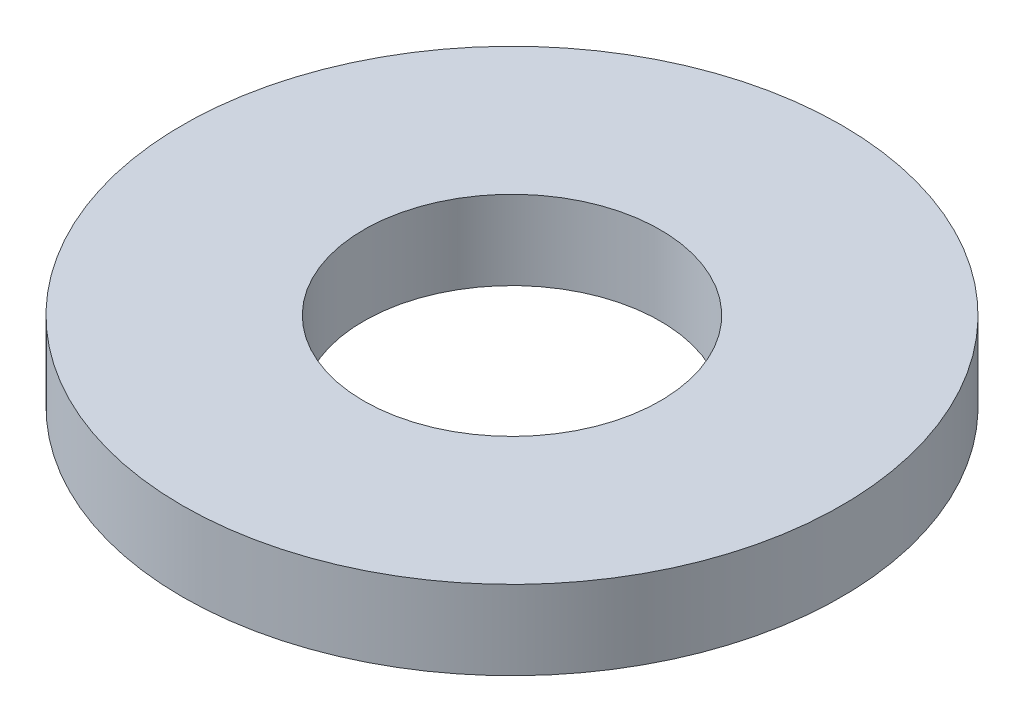
ISO-10303-21;
HEADER;
FILE_DESCRIPTION(('STEP AP214'),'2;1');
FILE_NAME('part.step','',(''),(''),'','','');
FILE_SCHEMA(('AUTOMOTIVE_DESIGN { 1 0 10303 214 1 1 1 1 }'));
ENDSEC;
DATA;
#1=APPLICATION_CONTEXT('core data for automotive mechanical design processes');
#2=APPLICATION_PROTOCOL_DEFINITION('international standard','automotive_design',2000,#1);
#3=PRODUCT_CONTEXT('',#1,'mechanical');
#4=PRODUCT('Part','Part','',(#3));
#5=PRODUCT_RELATED_PRODUCT_CATEGORY('part','',(#4));
#6=PRODUCT_DEFINITION_FORMATION('','',#4);
#7=PRODUCT_DEFINITION_CONTEXT('part definition',#1,'design');
#8=PRODUCT_DEFINITION('design','',#6,#7);
#9=PRODUCT_DEFINITION_SHAPE('','',#8);
#10=(LENGTH_UNIT() NAMED_UNIT(*) SI_UNIT(.MILLI.,.METRE.));
#11=(NAMED_UNIT(*) PLANE_ANGLE_UNIT() SI_UNIT($,.RADIAN.));
#12=(NAMED_UNIT(*) SI_UNIT($,.STERADIAN.) SOLID_ANGLE_UNIT());
#13=UNCERTAINTY_MEASURE_WITH_UNIT(LENGTH_MEASURE(1.E-05),#10,'distance_accuracy_value','');
#14=(GEOMETRIC_REPRESENTATION_CONTEXT(3) GLOBAL_UNCERTAINTY_ASSIGNED_CONTEXT((#13)) GLOBAL_UNIT_ASSIGNED_CONTEXT((#10,
#11,#12)) REPRESENTATION_CONTEXT('',''));
#15=CARTESIAN_POINT('',(0.,0.,0.));
#16=DIRECTION('',(0.,0.,1.));
#17=DIRECTION('',(1.,0.,0.));
#18=AXIS2_PLACEMENT_3D('',#15,#16,#17);
#19=CARTESIAN_POINT('',(0.,24.,0.));
#20=DIRECTION('',(0.,-1.,0.));
#21=DIRECTION('',(0.,0.,-1.));
#22=AXIS2_PLACEMENT_3D('',#19,#20,#21);
#23=CYLINDRICAL_SURFACE('',#22,100.);
#24=CARTESIAN_POINT('',(0.,24.,0.));
#25=DIRECTION('',(0.,1.,0.));
#26=DIRECTION('',(0.,0.,1.));
#27=AXIS2_PLACEMENT_3D('',#24,#25,#26);
#28=CIRCLE('',#27,100.);
#29=CARTESIAN_POINT('',(0.,24.,100.));
#30=VERTEX_POINT('',#29);
#31=EDGE_CURVE('E10',#30,#30,#28,.T.);
#32=ORIENTED_EDGE('',*,*,#31,.F.);
#33=EDGE_LOOP('',(#32));
#34=FACE_BOUND('',#33,.T.);
#35=CARTESIAN_POINT('',(0.,0.,0.));
#36=DIRECTION('',(0.,1.,0.));
#37=DIRECTION('',(0.,0.,1.));
#38=AXIS2_PLACEMENT_3D('',#35,#36,#37);
#39=CIRCLE('',#38,100.);
#40=CARTESIAN_POINT('',(0.,0.,100.));
#41=VERTEX_POINT('',#40);
#42=EDGE_CURVE('E37',#41,#41,#39,.T.);
#43=ORIENTED_EDGE('',*,*,#42,.T.);
#44=EDGE_LOOP('',(#43));
#45=FACE_BOUND('',#44,.T.);
#46=ADVANCED_FACE('F40',(#34,#45),#23,.T.);
#47=CARTESIAN_POINT('',(0.,24.,0.));
#48=DIRECTION('',(0.,1.,0.));
#49=DIRECTION('',(0.,0.,1.));
#50=AXIS2_PLACEMENT_3D('',#47,#48,#49);
#51=PLANE('',#50);
#52=CARTESIAN_POINT('',(0.,24.,0.));
#53=DIRECTION('',(0.,1.,0.));
#54=DIRECTION('',(0.,0.,1.));
#55=AXIS2_PLACEMENT_3D('',#52,#53,#54);
#56=CIRCLE('',#55,45.);
#57=CARTESIAN_POINT('',(0.,24.,45.));
#58=VERTEX_POINT('',#57);
#59=EDGE_CURVE('E50',#58,#58,#56,.T.);
#60=ORIENTED_EDGE('',*,*,#59,.F.);
#61=EDGE_LOOP('',(#60));
#62=FACE_BOUND('',#61,.T.);
#63=ORIENTED_EDGE('',*,*,#31,.T.);
#64=EDGE_LOOP('',(#63));
#65=FACE_BOUND('',#64,.T.);
#66=ADVANCED_FACE('F59',(#62,#65),#51,.T.);
#67=CARTESIAN_POINT('',(0.,0.,0.));
#68=DIRECTION('',(0.,1.,0.));
#69=DIRECTION('',(0.,0.,1.));
#70=AXIS2_PLACEMENT_3D('',#67,#68,#69);
#71=PLANE('',#70);
#72=CARTESIAN_POINT('',(0.,0.,0.));
#73=DIRECTION('',(0.,1.,0.));
#74=DIRECTION('',(0.,0.,1.));
#75=AXIS2_PLACEMENT_3D('',#72,#73,#74);
#76=CIRCLE('',#75,45.);
#77=CARTESIAN_POINT('',(0.,0.,45.));
#78=VERTEX_POINT('',#77);
#79=EDGE_CURVE('E47',#78,#78,#76,.T.);
#80=ORIENTED_EDGE('',*,*,#79,.T.);
#81=EDGE_LOOP('',(#80));
#82=FACE_BOUND('',#81,.T.);
#83=ORIENTED_EDGE('',*,*,#42,.F.);
#84=EDGE_LOOP('',(#83));
#85=FACE_BOUND('',#84,.T.);
#86=ADVANCED_FACE('F58',(#82,#85),#71,.F.);
#87=CARTESIAN_POINT('',(0.,24.,0.));
#88=DIRECTION('',(0.,-1.,0.));
#89=DIRECTION('',(0.,0.,-1.));
#90=AXIS2_PLACEMENT_3D('',#87,#88,#89);
#91=CYLINDRICAL_SURFACE('',#90,45.);
#92=ORIENTED_EDGE('',*,*,#59,.T.);
#93=EDGE_LOOP('',(#92));
#94=FACE_BOUND('',#93,.T.);
#95=ORIENTED_EDGE('',*,*,#79,.F.);
#96=EDGE_LOOP('',(#95));
#97=FACE_BOUND('',#96,.T.);
#98=ADVANCED_FACE('F54',(#94,#97),#91,.F.);
#99=CLOSED_SHELL('',(#46,#66,#86,#98));
#100=MANIFOLD_SOLID_BREP('B2',#99);
#101=ADVANCED_BREP_SHAPE_REPRESENTATION('',(#18,#100),#14);
#102=SHAPE_DEFINITION_REPRESENTATION(#9,#101);
ENDSEC;
END-ISO-10303-21;
